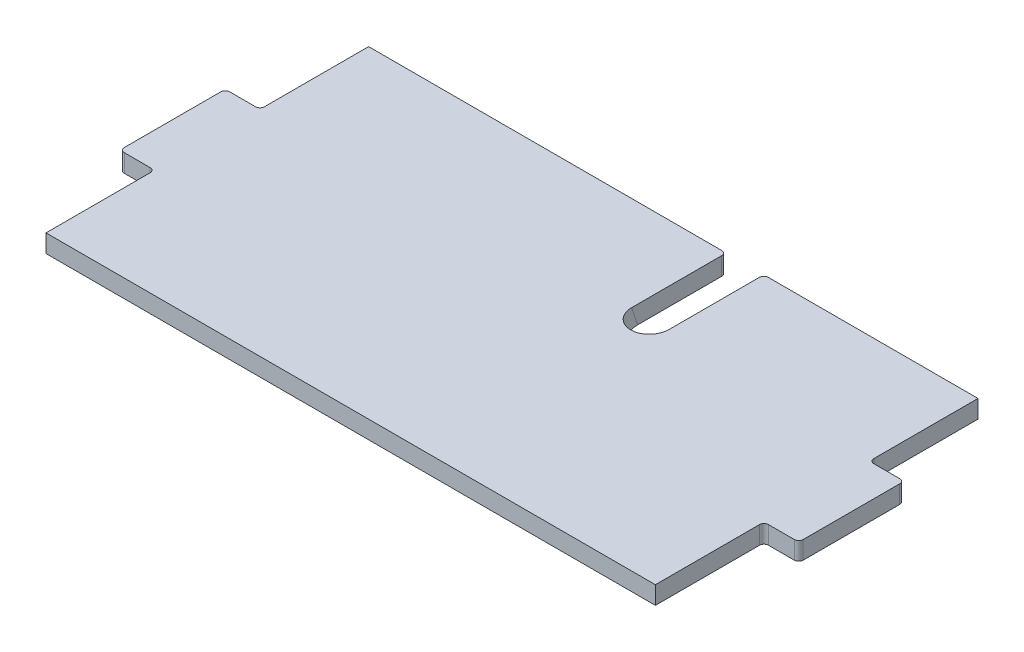
ISO-10303-21;
HEADER;
FILE_DESCRIPTION(('STEP AP214'),'2;1');
FILE_NAME('part.step','',(''),(''),'','','');
FILE_SCHEMA(('AUTOMOTIVE_DESIGN { 1 0 10303 214 1 1 1 1 }'));
ENDSEC;
DATA;
#1=APPLICATION_CONTEXT('core data for automotive mechanical design processes');
#2=APPLICATION_PROTOCOL_DEFINITION('international standard','automotive_design',2000,#1);
#3=PRODUCT_CONTEXT('',#1,'mechanical');
#4=PRODUCT('Part','Part','',(#3));
#5=PRODUCT_RELATED_PRODUCT_CATEGORY('part','',(#4));
#6=PRODUCT_DEFINITION_FORMATION('','',#4);
#7=PRODUCT_DEFINITION_CONTEXT('part definition',#1,'design');
#8=PRODUCT_DEFINITION('design','',#6,#7);
#9=PRODUCT_DEFINITION_SHAPE('','',#8);
#10=(LENGTH_UNIT() NAMED_UNIT(*) SI_UNIT(.MILLI.,.METRE.));
#11=(NAMED_UNIT(*) PLANE_ANGLE_UNIT() SI_UNIT($,.RADIAN.));
#12=(NAMED_UNIT(*) SI_UNIT($,.STERADIAN.) SOLID_ANGLE_UNIT());
#13=UNCERTAINTY_MEASURE_WITH_UNIT(LENGTH_MEASURE(1.E-05),#10,'distance_accuracy_value','');
#14=(GEOMETRIC_REPRESENTATION_CONTEXT(3) GLOBAL_UNCERTAINTY_ASSIGNED_CONTEXT((#13)) GLOBAL_UNIT_ASSIGNED_CONTEXT((#10,
#11,#12)) REPRESENTATION_CONTEXT('',''));
#15=CARTESIAN_POINT('',(0.,0.,0.));
#16=DIRECTION('',(0.,0.,1.));
#17=DIRECTION('',(1.,0.,0.));
#18=AXIS2_PLACEMENT_3D('',#15,#16,#17);
#19=CARTESIAN_POINT('',(-215.9,6.35,-88.9));
#20=DIRECTION('',(0.,0.,1.));
#21=DIRECTION('',(1.,0.,0.));
#22=AXIS2_PLACEMENT_3D('',#19,#20,#21);
#23=PLANE('',#22);
#24=DIRECTION('',(-1.,0.,0.));
#25=VECTOR('',#24,1.);
#26=CARTESIAN_POINT('',(-215.9,6.35,-88.9));
#27=LINE('',#26,#25);
#28=CARTESIAN_POINT('',(34.2899999999983,6.35,-88.9));
#29=VERTEX_POINT('',#28);
#30=CARTESIAN_POINT('',(-215.9,6.35,-88.9));
#31=VERTEX_POINT('',#30);
#32=EDGE_CURVE('E261',#29,#31,#27,.T.);
#33=ORIENTED_EDGE('',*,*,#32,.F.);
#34=DIRECTION('',(0.,1.,0.));
#35=VECTOR('',#34,1.);
#36=CARTESIAN_POINT('',(34.2899999999983,6.35,-88.9));
#37=LINE('',#36,#35);
#38=CARTESIAN_POINT('',(34.2899999999983,-6.35,-88.9));
#39=VERTEX_POINT('',#38);
#40=EDGE_CURVE('E226',#29,#39,#37,.F.);
#41=ORIENTED_EDGE('',*,*,#40,.T.);
#42=DIRECTION('',(-1.,0.,0.));
#43=VECTOR('',#42,1.);
#44=CARTESIAN_POINT('',(-215.9,-6.35,-88.9));
#45=LINE('',#44,#43);
#46=CARTESIAN_POINT('',(-215.9,-6.35,-88.9));
#47=VERTEX_POINT('',#46);
#48=EDGE_CURVE('E220',#39,#47,#45,.T.);
#49=ORIENTED_EDGE('',*,*,#48,.T.);
#50=DIRECTION('',(0.,-1.,0.));
#51=VECTOR('',#50,1.);
#52=CARTESIAN_POINT('',(-215.9,6.35,-88.9));
#53=LINE('',#52,#51);
#54=EDGE_CURVE('E223',#31,#47,#53,.T.);
#55=ORIENTED_EDGE('',*,*,#54,.F.);
#56=EDGE_LOOP('',(#33,#41,#49,#55));
#57=FACE_BOUND('',#56,.T.);
#58=ADVANCED_FACE('F44',(#57),#23,.F.);
#59=CARTESIAN_POINT('',(-215.9,6.35,-88.9));
#60=DIRECTION('',(1.,0.,0.));
#61=DIRECTION('',(0.,0.,-1.));
#62=AXIS2_PLACEMENT_3D('',#59,#60,#61);
#63=PLANE('',#62);
#64=DIRECTION('',(0.,0.,1.));
#65=VECTOR('',#64,1.);
#66=CARTESIAN_POINT('',(-215.9,-6.35,-88.9));
#67=LINE('',#66,#65);
#68=CARTESIAN_POINT('',(-215.9,-6.35,-15.113));
#69=VERTEX_POINT('',#68);
#70=EDGE_CURVE('E237',#47,#69,#67,.T.);
#71=ORIENTED_EDGE('',*,*,#70,.T.);
#72=DIRECTION('',(0.,-1.,0.));
#73=VECTOR('',#72,1.);
#74=CARTESIAN_POINT('',(-215.9,6.35,-15.113));
#75=LINE('',#74,#73);
#76=CARTESIAN_POINT('',(-215.9,6.35,-15.113));
#77=VERTEX_POINT('',#76);
#78=EDGE_CURVE('E439',#69,#77,#75,.F.);
#79=ORIENTED_EDGE('',*,*,#78,.T.);
#80=DIRECTION('',(0.,0.,1.));
#81=VECTOR('',#80,1.);
#82=CARTESIAN_POINT('',(-215.9,6.35,-88.9));
#83=LINE('',#82,#81);
#84=EDGE_CURVE('E240',#31,#77,#83,.T.);
#85=ORIENTED_EDGE('',*,*,#84,.F.);
#86=ORIENTED_EDGE('',*,*,#54,.T.);
#87=EDGE_LOOP('',(#71,#79,#85,#86));
#88=FACE_BOUND('',#87,.T.);
#89=ADVANCED_FACE('F236',(#88),#63,.F.);
#90=CARTESIAN_POINT('',(-241.3,6.35,-11.938));
#91=DIRECTION('',(0.,0.,1.));
#92=DIRECTION('',(1.,0.,0.));
#93=AXIS2_PLACEMENT_3D('',#90,#91,#92);
#94=PLANE('',#93);
#95=DIRECTION('',(-1.,0.,0.));
#96=VECTOR('',#95,1.);
#97=CARTESIAN_POINT('',(-241.3,-6.35,-11.938));
#98=LINE('',#97,#96);
#99=CARTESIAN_POINT('',(-219.075,-6.35,-11.938));
#100=VERTEX_POINT('',#99);
#101=CARTESIAN_POINT('',(-237.363,-6.35,-11.938));
#102=VERTEX_POINT('',#101);
#103=EDGE_CURVE('E242',#100,#102,#98,.T.);
#104=ORIENTED_EDGE('',*,*,#103,.T.);
#105=DIRECTION('',(0.,-1.,0.));
#106=VECTOR('',#105,1.);
#107=CARTESIAN_POINT('',(-237.363,6.35,-11.938));
#108=LINE('',#107,#106);
#109=CARTESIAN_POINT('',(-237.363,6.35,-11.938));
#110=VERTEX_POINT('',#109);
#111=EDGE_CURVE('E436',#102,#110,#108,.F.);
#112=ORIENTED_EDGE('',*,*,#111,.T.);
#113=DIRECTION('',(-1.,0.,0.));
#114=VECTOR('',#113,1.);
#115=CARTESIAN_POINT('',(-241.3,6.35,-11.938));
#116=LINE('',#115,#114);
#117=CARTESIAN_POINT('',(-219.075,6.35,-11.938));
#118=VERTEX_POINT('',#117);
#119=EDGE_CURVE('E280',#118,#110,#116,.T.);
#120=ORIENTED_EDGE('',*,*,#119,.F.);
#121=DIRECTION('',(0.,-1.,0.));
#122=VECTOR('',#121,1.);
#123=CARTESIAN_POINT('',(-219.075,-6.35,-11.938));
#124=LINE('',#123,#122);
#125=EDGE_CURVE('E432',#118,#100,#124,.T.);
#126=ORIENTED_EDGE('',*,*,#125,.T.);
#127=EDGE_LOOP('',(#104,#112,#120,#126));
#128=FACE_BOUND('',#127,.T.);
#129=ADVANCED_FACE('F576',(#128),#94,.F.);
#130=CARTESIAN_POINT('',(-240.538,6.35,-12.7));
#131=DIRECTION('',(1.,0.,0.));
#132=DIRECTION('',(0.,0.,-1.));
#133=AXIS2_PLACEMENT_3D('',#130,#131,#132);
#134=PLANE('',#133);
#135=DIRECTION('',(0.,0.,1.));
#136=VECTOR('',#135,1.);
#137=CARTESIAN_POINT('',(-240.538,-6.35,-12.7));
#138=LINE('',#137,#136);
#139=CARTESIAN_POINT('',(-240.538,-6.35,-8.76299999999999));
#140=VERTEX_POINT('',#139);
#141=CARTESIAN_POINT('',(-240.538,-6.35,59.563));
#142=VERTEX_POINT('',#141);
#143=EDGE_CURVE('E309',#140,#142,#138,.T.);
#144=ORIENTED_EDGE('',*,*,#143,.T.);
#145=DIRECTION('',(0.,-1.,0.));
#146=VECTOR('',#145,1.);
#147=CARTESIAN_POINT('',(-240.538,6.35,59.563));
#148=LINE('',#147,#146);
#149=CARTESIAN_POINT('',(-240.538,6.35,59.563));
#150=VERTEX_POINT('',#149);
#151=EDGE_CURVE('E429',#142,#150,#148,.F.);
#152=ORIENTED_EDGE('',*,*,#151,.T.);
#153=DIRECTION('',(0.,0.,1.));
#154=VECTOR('',#153,1.);
#155=CARTESIAN_POINT('',(-240.538,6.35,-12.7));
#156=LINE('',#155,#154);
#157=CARTESIAN_POINT('',(-240.538,6.35,-8.76299999999999));
#158=VERTEX_POINT('',#157);
#159=EDGE_CURVE('E319',#158,#150,#156,.T.);
#160=ORIENTED_EDGE('',*,*,#159,.F.);
#161=DIRECTION('',(0.,-1.,0.));
#162=VECTOR('',#161,1.);
#163=CARTESIAN_POINT('',(-240.538,6.35,-8.76299999999999));
#164=LINE('',#163,#162);
#165=EDGE_CURVE('E425',#158,#140,#164,.T.);
#166=ORIENTED_EDGE('',*,*,#165,.T.);
#167=EDGE_LOOP('',(#144,#152,#160,#166));
#168=FACE_BOUND('',#167,.T.);
#169=ADVANCED_FACE('F600',(#168),#134,.F.);
#170=CARTESIAN_POINT('',(-215.9,6.35,62.738));
#171=DIRECTION('',(0.,0.,-1.));
#172=DIRECTION('',(-1.,0.,0.));
#173=AXIS2_PLACEMENT_3D('',#170,#171,#172);
#174=PLANE('',#173);
#175=DIRECTION('',(1.,0.,0.));
#176=VECTOR('',#175,1.);
#177=CARTESIAN_POINT('',(-215.9,-6.35,62.738));
#178=LINE('',#177,#176);
#179=CARTESIAN_POINT('',(-237.363,-6.35,62.738));
#180=VERTEX_POINT('',#179);
#181=CARTESIAN_POINT('',(-219.075,-6.35,62.738));
#182=VERTEX_POINT('',#181);
#183=EDGE_CURVE('E305',#180,#182,#178,.T.);
#184=ORIENTED_EDGE('',*,*,#183,.T.);
#185=DIRECTION('',(0.,-1.,0.));
#186=VECTOR('',#185,1.);
#187=CARTESIAN_POINT('',(-219.075,6.35,62.738));
#188=LINE('',#187,#186);
#189=CARTESIAN_POINT('',(-219.075,6.35,62.738));
#190=VERTEX_POINT('',#189);
#191=EDGE_CURVE('E422',#182,#190,#188,.F.);
#192=ORIENTED_EDGE('',*,*,#191,.T.);
#193=DIRECTION('',(1.,0.,0.));
#194=VECTOR('',#193,1.);
#195=CARTESIAN_POINT('',(-215.9,6.35,62.738));
#196=LINE('',#195,#194);
#197=CARTESIAN_POINT('',(-237.363,6.35,62.738));
#198=VERTEX_POINT('',#197);
#199=EDGE_CURVE('E277',#198,#190,#196,.T.);
#200=ORIENTED_EDGE('',*,*,#199,.F.);
#201=DIRECTION('',(0.,-1.,0.));
#202=VECTOR('',#201,1.);
#203=CARTESIAN_POINT('',(-237.363,6.35,62.738));
#204=LINE('',#203,#202);
#205=EDGE_CURVE('E418',#198,#180,#204,.T.);
#206=ORIENTED_EDGE('',*,*,#205,.T.);
#207=EDGE_LOOP('',(#184,#192,#200,#206));
#208=FACE_BOUND('',#207,.T.);
#209=ADVANCED_FACE('F596',(#208),#174,.F.);
#210=CARTESIAN_POINT('',(-215.9,6.35,63.5));
#211=DIRECTION('',(1.,0.,0.));
#212=DIRECTION('',(0.,0.,-1.));
#213=AXIS2_PLACEMENT_3D('',#210,#211,#212);
#214=PLANE('',#213);
#215=DIRECTION('',(0.,0.,1.));
#216=VECTOR('',#215,1.);
#217=CARTESIAN_POINT('',(-215.9,6.35,63.5));
#218=LINE('',#217,#216);
#219=CARTESIAN_POINT('',(-215.9,6.35,65.913));
#220=VERTEX_POINT('',#219);
#221=CARTESIAN_POINT('',(-215.9,6.35,139.7));
#222=VERTEX_POINT('',#221);
#223=EDGE_CURVE('E274',#220,#222,#218,.T.);
#224=ORIENTED_EDGE('',*,*,#223,.F.);
#225=DIRECTION('',(0.,-1.,0.));
#226=VECTOR('',#225,1.);
#227=CARTESIAN_POINT('',(-215.9,-6.35,65.913));
#228=LINE('',#227,#226);
#229=CARTESIAN_POINT('',(-215.9,-6.35,65.913));
#230=VERTEX_POINT('',#229);
#231=EDGE_CURVE('E414',#220,#230,#228,.T.);
#232=ORIENTED_EDGE('',*,*,#231,.T.);
#233=DIRECTION('',(0.,0.,1.));
#234=VECTOR('',#233,1.);
#235=CARTESIAN_POINT('',(-215.9,-6.35,63.5));
#236=LINE('',#235,#234);
#237=CARTESIAN_POINT('',(-215.9,-6.35,139.7));
#238=VERTEX_POINT('',#237);
#239=EDGE_CURVE('E255',#230,#238,#236,.T.);
#240=ORIENTED_EDGE('',*,*,#239,.T.);
#241=DIRECTION('',(0.,-1.,0.));
#242=VECTOR('',#241,1.);
#243=CARTESIAN_POINT('',(-215.9,6.35,139.7));
#244=LINE('',#243,#242);
#245=EDGE_CURVE('E486',#222,#238,#244,.T.);
#246=ORIENTED_EDGE('',*,*,#245,.F.);
#247=EDGE_LOOP('',(#224,#232,#240,#246));
#248=FACE_BOUND('',#247,.T.);
#249=ADVANCED_FACE('F497',(#248),#214,.F.);
#250=CARTESIAN_POINT('',(-215.9,6.35,139.7));
#251=DIRECTION('',(0.,0.,-1.));
#252=DIRECTION('',(-1.,0.,0.));
#253=AXIS2_PLACEMENT_3D('',#250,#251,#252);
#254=PLANE('',#253);
#255=DIRECTION('',(1.,0.,0.));
#256=VECTOR('',#255,1.);
#257=CARTESIAN_POINT('',(-215.9,-6.35,139.7));
#258=LINE('',#257,#256);
#259=CARTESIAN_POINT('',(215.9,-6.35,139.7));
#260=VERTEX_POINT('',#259);
#261=EDGE_CURVE('E490',#238,#260,#258,.T.);
#262=ORIENTED_EDGE('',*,*,#261,.T.);
#263=DIRECTION('',(0.,-1.,0.));
#264=VECTOR('',#263,1.);
#265=CARTESIAN_POINT('',(215.9,6.35,139.7));
#266=LINE('',#265,#264);
#267=CARTESIAN_POINT('',(215.9,6.35,139.7));
#268=VERTEX_POINT('',#267);
#269=EDGE_CURVE('E287',#268,#260,#266,.T.);
#270=ORIENTED_EDGE('',*,*,#269,.F.);
#271=DIRECTION('',(1.,0.,0.));
#272=VECTOR('',#271,1.);
#273=CARTESIAN_POINT('',(-215.9,6.35,139.7));
#274=LINE('',#273,#272);
#275=EDGE_CURVE('E271',#222,#268,#274,.T.);
#276=ORIENTED_EDGE('',*,*,#275,.F.);
#277=ORIENTED_EDGE('',*,*,#245,.T.);
#278=EDGE_LOOP('',(#262,#270,#276,#277));
#279=FACE_BOUND('',#278,.T.);
#280=ADVANCED_FACE('F502',(#279),#254,.F.);
#281=CARTESIAN_POINT('',(215.9,6.35,63.5));
#282=DIRECTION('',(-1.,0.,0.));
#283=DIRECTION('',(0.,0.,1.));
#284=AXIS2_PLACEMENT_3D('',#281,#282,#283);
#285=PLANE('',#284);
#286=DIRECTION('',(0.,0.,-1.));
#287=VECTOR('',#286,1.);
#288=CARTESIAN_POINT('',(215.9,-6.35,63.5));
#289=LINE('',#288,#287);
#290=CARTESIAN_POINT('',(215.9,-6.35,65.913));
#291=VERTEX_POINT('',#290);
#292=EDGE_CURVE('E482',#260,#291,#289,.T.);
#293=ORIENTED_EDGE('',*,*,#292,.T.);
#294=DIRECTION('',(0.,-1.,0.));
#295=VECTOR('',#294,1.);
#296=CARTESIAN_POINT('',(215.9,6.35,65.913));
#297=LINE('',#296,#295);
#298=CARTESIAN_POINT('',(215.9,6.35,65.913));
#299=VERTEX_POINT('',#298);
#300=EDGE_CURVE('E411',#291,#299,#297,.F.);
#301=ORIENTED_EDGE('',*,*,#300,.T.);
#302=DIRECTION('',(0.,0.,-1.));
#303=VECTOR('',#302,1.);
#304=CARTESIAN_POINT('',(215.9,6.35,63.5));
#305=LINE('',#304,#303);
#306=EDGE_CURVE('E266',#268,#299,#305,.T.);
#307=ORIENTED_EDGE('',*,*,#306,.F.);
#308=ORIENTED_EDGE('',*,*,#269,.T.);
#309=EDGE_LOOP('',(#293,#301,#307,#308));
#310=FACE_BOUND('',#309,.T.);
#311=ADVANCED_FACE('F508',(#310),#285,.F.);
#312=CARTESIAN_POINT('',(215.9,6.35,62.738));
#313=DIRECTION('',(0.,0.,-1.));
#314=DIRECTION('',(-1.,0.,0.));
#315=AXIS2_PLACEMENT_3D('',#312,#313,#314);
#316=PLANE('',#315);
#317=DIRECTION('',(1.,0.,0.));
#318=VECTOR('',#317,1.);
#319=CARTESIAN_POINT('',(215.9,-6.35,62.738));
#320=LINE('',#319,#318);
#321=CARTESIAN_POINT('',(219.075,-6.35,62.738));
#322=VERTEX_POINT('',#321);
#323=CARTESIAN_POINT('',(237.363,-6.35,62.738));
#324=VERTEX_POINT('',#323);
#325=EDGE_CURVE('E282',#322,#324,#320,.T.);
#326=ORIENTED_EDGE('',*,*,#325,.T.);
#327=DIRECTION('',(0.,-1.,0.));
#328=VECTOR('',#327,1.);
#329=CARTESIAN_POINT('',(237.363,6.35,62.738));
#330=LINE('',#329,#328);
#331=CARTESIAN_POINT('',(237.363,6.35,62.738));
#332=VERTEX_POINT('',#331);
#333=EDGE_CURVE('E408',#324,#332,#330,.F.);
#334=ORIENTED_EDGE('',*,*,#333,.T.);
#335=DIRECTION('',(1.,0.,0.));
#336=VECTOR('',#335,1.);
#337=CARTESIAN_POINT('',(215.9,6.35,62.738));
#338=LINE('',#337,#336);
#339=CARTESIAN_POINT('',(219.075,6.35,62.738));
#340=VERTEX_POINT('',#339);
#341=EDGE_CURVE('E270',#340,#332,#338,.T.);
#342=ORIENTED_EDGE('',*,*,#341,.F.);
#343=DIRECTION('',(0.,-1.,0.));
#344=VECTOR('',#343,1.);
#345=CARTESIAN_POINT('',(219.075,-6.35,62.738));
#346=LINE('',#345,#344);
#347=EDGE_CURVE('E404',#340,#322,#346,.T.);
#348=ORIENTED_EDGE('',*,*,#347,.T.);
#349=EDGE_LOOP('',(#326,#334,#342,#348));
#350=FACE_BOUND('',#349,.T.);
#351=ADVANCED_FACE('F518',(#350),#316,.F.);
#352=CARTESIAN_POINT('',(240.538,6.35,-12.7));
#353=DIRECTION('',(-1.,0.,0.));
#354=DIRECTION('',(0.,0.,1.));
#355=AXIS2_PLACEMENT_3D('',#352,#353,#354);
#356=PLANE('',#355);
#357=DIRECTION('',(0.,0.,-1.));
#358=VECTOR('',#357,1.);
#359=CARTESIAN_POINT('',(240.538,-6.35,-12.7));
#360=LINE('',#359,#358);
#361=CARTESIAN_POINT('',(240.538,-6.35,59.563));
#362=VERTEX_POINT('',#361);
#363=CARTESIAN_POINT('',(240.538,-6.35,-8.76299999999999));
#364=VERTEX_POINT('',#363);
#365=EDGE_CURVE('E286',#362,#364,#360,.T.);
#366=ORIENTED_EDGE('',*,*,#365,.T.);
#367=DIRECTION('',(0.,-1.,0.));
#368=VECTOR('',#367,1.);
#369=CARTESIAN_POINT('',(240.538,6.35,-8.76299999999999));
#370=LINE('',#369,#368);
#371=CARTESIAN_POINT('',(240.538,6.35,-8.76299999999999));
#372=VERTEX_POINT('',#371);
#373=EDGE_CURVE('E384',#364,#372,#370,.F.);
#374=ORIENTED_EDGE('',*,*,#373,.T.);
#375=DIRECTION('',(0.,0.,-1.));
#376=VECTOR('',#375,1.);
#377=CARTESIAN_POINT('',(240.538,6.35,-12.7));
#378=LINE('',#377,#376);
#379=CARTESIAN_POINT('',(240.538,6.35,59.563));
#380=VERTEX_POINT('',#379);
#381=EDGE_CURVE('E291',#380,#372,#378,.T.);
#382=ORIENTED_EDGE('',*,*,#381,.F.);
#383=DIRECTION('',(0.,-1.,0.));
#384=VECTOR('',#383,1.);
#385=CARTESIAN_POINT('',(240.538,6.35,59.563));
#386=LINE('',#385,#384);
#387=EDGE_CURVE('E380',#380,#362,#386,.T.);
#388=ORIENTED_EDGE('',*,*,#387,.T.);
#389=EDGE_LOOP('',(#366,#374,#382,#388));
#390=FACE_BOUND('',#389,.T.);
#391=ADVANCED_FACE('F526',(#390),#356,.F.);
#392=CARTESIAN_POINT('',(241.3,6.35,-11.938));
#393=DIRECTION('',(0.,0.,1.));
#394=DIRECTION('',(1.,0.,0.));
#395=AXIS2_PLACEMENT_3D('',#392,#393,#394);
#396=PLANE('',#395);
#397=DIRECTION('',(-1.,0.,0.));
#398=VECTOR('',#397,1.);
#399=CARTESIAN_POINT('',(241.3,-6.35,-11.938));
#400=LINE('',#399,#398);
#401=CARTESIAN_POINT('',(237.363,-6.35,-11.938));
#402=VERTEX_POINT('',#401);
#403=CARTESIAN_POINT('',(219.075,-6.35,-11.938));
#404=VERTEX_POINT('',#403);
#405=EDGE_CURVE('E298',#402,#404,#400,.T.);
#406=ORIENTED_EDGE('',*,*,#405,.T.);
#407=DIRECTION('',(0.,-1.,0.));
#408=VECTOR('',#407,1.);
#409=CARTESIAN_POINT('',(219.075,6.35,-11.938));
#410=LINE('',#409,#408);
#411=CARTESIAN_POINT('',(219.075,6.35,-11.938));
#412=VERTEX_POINT('',#411);
#413=EDGE_CURVE('E359',#404,#412,#410,.F.);
#414=ORIENTED_EDGE('',*,*,#413,.T.);
#415=DIRECTION('',(-1.,0.,0.));
#416=VECTOR('',#415,1.);
#417=CARTESIAN_POINT('',(241.3,6.35,-11.938));
#418=LINE('',#417,#416);
#419=CARTESIAN_POINT('',(237.363,6.35,-11.938));
#420=VERTEX_POINT('',#419);
#421=EDGE_CURVE('E265',#420,#412,#418,.T.);
#422=ORIENTED_EDGE('',*,*,#421,.F.);
#423=DIRECTION('',(0.,-1.,0.));
#424=VECTOR('',#423,1.);
#425=CARTESIAN_POINT('',(237.363,6.35,-11.938));
#426=LINE('',#425,#424);
#427=EDGE_CURVE('E355',#420,#402,#426,.T.);
#428=ORIENTED_EDGE('',*,*,#427,.T.);
#429=EDGE_LOOP('',(#406,#414,#422,#428));
#430=FACE_BOUND('',#429,.T.);
#431=ADVANCED_FACE('F535',(#430),#396,.F.);
#432=CARTESIAN_POINT('',(215.9,6.35,-88.9));
#433=DIRECTION('',(-1.,0.,0.));
#434=DIRECTION('',(0.,0.,1.));
#435=AXIS2_PLACEMENT_3D('',#432,#433,#434);
#436=PLANE('',#435);
#437=DIRECTION('',(0.,0.,-1.));
#438=VECTOR('',#437,1.);
#439=CARTESIAN_POINT('',(215.9,6.35,-88.9));
#440=LINE('',#439,#438);
#441=CARTESIAN_POINT('',(215.9,6.35,-15.113));
#442=VERTEX_POINT('',#441);
#443=CARTESIAN_POINT('',(215.9,6.35,-88.9));
#444=VERTEX_POINT('',#443);
#445=EDGE_CURVE('E262',#442,#444,#440,.T.);
#446=ORIENTED_EDGE('',*,*,#445,.F.);
#447=DIRECTION('',(0.,-1.,0.));
#448=VECTOR('',#447,1.);
#449=CARTESIAN_POINT('',(215.9,-6.35,-15.113));
#450=LINE('',#449,#448);
#451=CARTESIAN_POINT('',(215.9,-6.35,-15.113));
#452=VERTEX_POINT('',#451);
#453=EDGE_CURVE('E348',#442,#452,#450,.T.);
#454=ORIENTED_EDGE('',*,*,#453,.T.);
#455=DIRECTION('',(0.,0.,-1.));
#456=VECTOR('',#455,1.);
#457=CARTESIAN_POINT('',(215.9,-6.35,-88.9));
#458=LINE('',#457,#456);
#459=CARTESIAN_POINT('',(215.9,-6.35,-88.9));
#460=VERTEX_POINT('',#459);
#461=EDGE_CURVE('E232',#452,#460,#458,.T.);
#462=ORIENTED_EDGE('',*,*,#461,.T.);
#463=DIRECTION('',(0.,-1.,0.));
#464=VECTOR('',#463,1.);
#465=CARTESIAN_POINT('',(215.9,6.35,-88.9));
#466=LINE('',#465,#464);
#467=EDGE_CURVE('E336',#444,#460,#466,.T.);
#468=ORIENTED_EDGE('',*,*,#467,.F.);
#469=EDGE_LOOP('',(#446,#454,#462,#468));
#470=FACE_BOUND('',#469,.T.);
#471=ADVANCED_FACE('F543',(#470),#436,.F.);
#472=CARTESIAN_POINT('',(67.3099999999985,-6.35,-88.9));
#473=VERTEX_POINT('',#472);
#474=EDGE_CURVE('E231',#460,#473,#45,.T.);
#475=ORIENTED_EDGE('',*,*,#474,.T.);
#476=DIRECTION('',(0.,-1.,0.));
#477=VECTOR('',#476,1.);
#478=CARTESIAN_POINT('',(67.3099999999985,6.35,-88.9));
#479=LINE('',#478,#477);
#480=CARTESIAN_POINT('',(67.3099999999985,6.35,-88.9));
#481=VERTEX_POINT('',#480);
#482=EDGE_CURVE('E68',#473,#481,#479,.F.);
#483=ORIENTED_EDGE('',*,*,#482,.T.);
#484=EDGE_CURVE('E257',#444,#481,#27,.T.);
#485=ORIENTED_EDGE('',*,*,#484,.F.);
#486=ORIENTED_EDGE('',*,*,#467,.T.);
#487=EDGE_LOOP('',(#475,#483,#485,#486));
#488=FACE_BOUND('',#487,.T.);
#489=ADVANCED_FACE('F546',(#488),#23,.F.);
#490=CARTESIAN_POINT('',(0.,6.35,0.));
#491=DIRECTION('',(0.,1.,0.));
#492=DIRECTION('',(0.,0.,1.));
#493=AXIS2_PLACEMENT_3D('',#490,#491,#492);
#494=PLANE('',#493);
#495=ORIENTED_EDGE('',*,*,#381,.T.);
#496=CARTESIAN_POINT('',(237.363,6.35,-8.76299999999999));
#497=DIRECTION('',(0.,1.,0.));
#498=DIRECTION('',(0.,0.,1.));
#499=AXIS2_PLACEMENT_3D('',#496,#497,#498);
#500=CIRCLE('',#499,3.175);
#501=EDGE_CURVE('E401',#372,#420,#500,.T.);
#502=ORIENTED_EDGE('',*,*,#501,.T.);
#503=ORIENTED_EDGE('',*,*,#421,.T.);
#504=CARTESIAN_POINT('',(219.075,6.35,-15.113));
#505=DIRECTION('',(0.,1.,0.));
#506=DIRECTION('',(0.,0.,1.));
#507=AXIS2_PLACEMENT_3D('',#504,#505,#506);
#508=CIRCLE('',#507,3.175);
#509=EDGE_CURVE('E457',#412,#442,#508,.F.);
#510=ORIENTED_EDGE('',*,*,#509,.T.);
#511=ORIENTED_EDGE('',*,*,#445,.T.);
#512=ORIENTED_EDGE('',*,*,#484,.T.);
#513=CARTESIAN_POINT('',(67.3099999999985,6.35,-85.725));
#514=DIRECTION('',(0.,1.,0.));
#515=DIRECTION('',(0.,0.,1.));
#516=AXIS2_PLACEMENT_3D('',#513,#514,#515);
#517=CIRCLE('',#516,3.175);
#518=CARTESIAN_POINT('',(64.1349999999985,6.35,-85.725));
#519=VERTEX_POINT('',#518);
#520=EDGE_CURVE('E60',#481,#519,#517,.T.);
#521=ORIENTED_EDGE('',*,*,#520,.T.);
#522=DIRECTION('',(0.,0.,-1.));
#523=VECTOR('',#522,1.);
#524=CARTESIAN_POINT('',(64.1349999999985,6.35,0.));
#525=LINE('',#524,#523);
#526=CARTESIAN_POINT('',(64.1349999999985,6.34999999999997,-21.9362936905283));
#527=VERTEX_POINT('',#526);
#528=EDGE_CURVE('E329',#527,#519,#525,.T.);
#529=ORIENTED_EDGE('',*,*,#528,.F.);
#530=CARTESIAN_POINT('',(50.7999999999984,6.34999999999997,-21.9362936905283));
#531=DIRECTION('',(0.,1.,0.));
#532=DIRECTION('',(0.,0.,-1.));
#533=AXIS2_PLACEMENT_3D('',#530,#531,#532);
#534=ELLIPSE('',#533,14.0350269898215,13.3350000000001);
#535=CARTESIAN_POINT('',(37.4649999999983,6.34999999999997,-21.9362936905283));
#536=VERTEX_POINT('',#535);
#537=EDGE_CURVE('E281',#527,#536,#534,.F.);
#538=ORIENTED_EDGE('',*,*,#537,.T.);
#539=DIRECTION('',(0.,0.,-1.));
#540=VECTOR('',#539,1.);
#541=CARTESIAN_POINT('',(37.4649999999983,6.35,139.701));
#542=LINE('',#541,#540);
#543=CARTESIAN_POINT('',(37.4649999999983,6.35,-85.725));
#544=VERTEX_POINT('',#543);
#545=EDGE_CURVE('E332',#536,#544,#542,.T.);
#546=ORIENTED_EDGE('',*,*,#545,.T.);
#547=CARTESIAN_POINT('',(34.2899999999983,6.35,-85.725));
#548=DIRECTION('',(0.,1.,0.));
#549=DIRECTION('',(0.,0.,1.));
#550=AXIS2_PLACEMENT_3D('',#547,#548,#549);
#551=CIRCLE('',#550,3.175);
#552=EDGE_CURVE('E389',#544,#29,#551,.T.);
#553=ORIENTED_EDGE('',*,*,#552,.T.);
#554=ORIENTED_EDGE('',*,*,#32,.T.);
#555=ORIENTED_EDGE('',*,*,#84,.T.);
#556=CARTESIAN_POINT('',(-219.075,6.35,-15.113));
#557=DIRECTION('',(0.,1.,0.));
#558=DIRECTION('',(0.,0.,1.));
#559=AXIS2_PLACEMENT_3D('',#556,#557,#558);
#560=CIRCLE('',#559,3.175);
#561=EDGE_CURVE('E12',#77,#118,#560,.F.);
#562=ORIENTED_EDGE('',*,*,#561,.T.);
#563=ORIENTED_EDGE('',*,*,#119,.T.);
#564=CARTESIAN_POINT('',(-237.363,6.35,-8.76299999999999));
#565=DIRECTION('',(0.,1.,0.));
#566=DIRECTION('',(0.,0.,1.));
#567=AXIS2_PLACEMENT_3D('',#564,#565,#566);
#568=CIRCLE('',#567,3.175);
#569=EDGE_CURVE('E392',#110,#158,#568,.T.);
#570=ORIENTED_EDGE('',*,*,#569,.T.);
#571=ORIENTED_EDGE('',*,*,#159,.T.);
#572=CARTESIAN_POINT('',(-237.363,6.35,59.563));
#573=DIRECTION('',(0.,1.,0.));
#574=DIRECTION('',(0.,0.,1.));
#575=AXIS2_PLACEMENT_3D('',#572,#573,#574);
#576=CIRCLE('',#575,3.175);
#577=EDGE_CURVE('E395',#150,#198,#576,.T.);
#578=ORIENTED_EDGE('',*,*,#577,.T.);
#579=ORIENTED_EDGE('',*,*,#199,.T.);
#580=CARTESIAN_POINT('',(-219.075,6.35,65.913));
#581=DIRECTION('',(0.,1.,0.));
#582=DIRECTION('',(0.,0.,1.));
#583=AXIS2_PLACEMENT_3D('',#580,#581,#582);
#584=CIRCLE('',#583,3.175);
#585=EDGE_CURVE('E469',#190,#220,#584,.F.);
#586=ORIENTED_EDGE('',*,*,#585,.T.);
#587=ORIENTED_EDGE('',*,*,#223,.T.);
#588=ORIENTED_EDGE('',*,*,#275,.T.);
#589=ORIENTED_EDGE('',*,*,#306,.T.);
#590=CARTESIAN_POINT('',(219.075,6.35,65.913));
#591=DIRECTION('',(0.,1.,0.));
#592=DIRECTION('',(0.,0.,1.));
#593=AXIS2_PLACEMENT_3D('',#590,#591,#592);
#594=CIRCLE('',#593,3.175);
#595=EDGE_CURVE('E463',#299,#340,#594,.F.);
#596=ORIENTED_EDGE('',*,*,#595,.T.);
#597=ORIENTED_EDGE('',*,*,#341,.T.);
#598=CARTESIAN_POINT('',(237.363,6.35,59.563));
#599=DIRECTION('',(0.,1.,0.));
#600=DIRECTION('',(0.,0.,1.));
#601=AXIS2_PLACEMENT_3D('',#598,#599,#600);
#602=CIRCLE('',#601,3.175);
#603=EDGE_CURVE('E398',#332,#380,#602,.T.);
#604=ORIENTED_EDGE('',*,*,#603,.T.);
#605=EDGE_LOOP('',(#495,#502,#503,#510,#511,#512,#521,#529,#538,#546,#553,#554,#555,#562,#563,
#570,#571,#578,#579,#586,#587,#588,#589,#596,#597,#604));
#606=FACE_BOUND('',#605,.T.);
#607=ADVANCED_FACE('F515',(#606),#494,.T.);
#608=CARTESIAN_POINT('',(0.,-6.35,0.));
#609=DIRECTION('',(0.,1.,0.));
#610=DIRECTION('',(0.,0.,1.));
#611=AXIS2_PLACEMENT_3D('',#608,#609,#610);
#612=PLANE('',#611);
#613=ORIENTED_EDGE('',*,*,#405,.F.);
#614=CARTESIAN_POINT('',(237.363,-6.35,-8.76299999999999));
#615=DIRECTION('',(0.,1.,0.));
#616=DIRECTION('',(0.,0.,1.));
#617=AXIS2_PLACEMENT_3D('',#614,#615,#616);
#618=CIRCLE('',#617,3.175);
#619=EDGE_CURVE('E377',#402,#364,#618,.F.);
#620=ORIENTED_EDGE('',*,*,#619,.T.);
#621=ORIENTED_EDGE('',*,*,#365,.F.);
#622=CARTESIAN_POINT('',(237.363,-6.35,59.563));
#623=DIRECTION('',(0.,1.,0.));
#624=DIRECTION('',(0.,0.,1.));
#625=AXIS2_PLACEMENT_3D('',#622,#623,#624);
#626=CIRCLE('',#625,3.175);
#627=EDGE_CURVE('E374',#362,#324,#626,.F.);
#628=ORIENTED_EDGE('',*,*,#627,.T.);
#629=ORIENTED_EDGE('',*,*,#325,.F.);
#630=CARTESIAN_POINT('',(219.075,-6.35,65.913));
#631=DIRECTION('',(0.,1.,0.));
#632=DIRECTION('',(0.,0.,1.));
#633=AXIS2_PLACEMENT_3D('',#630,#631,#632);
#634=CIRCLE('',#633,3.175);
#635=EDGE_CURVE('E460',#322,#291,#634,.T.);
#636=ORIENTED_EDGE('',*,*,#635,.T.);
#637=ORIENTED_EDGE('',*,*,#292,.F.);
#638=ORIENTED_EDGE('',*,*,#261,.F.);
#639=ORIENTED_EDGE('',*,*,#239,.F.);
#640=CARTESIAN_POINT('',(-219.075,-6.35,65.913));
#641=DIRECTION('',(0.,1.,0.));
#642=DIRECTION('',(0.,0.,1.));
#643=AXIS2_PLACEMENT_3D('',#640,#641,#642);
#644=CIRCLE('',#643,3.175);
#645=EDGE_CURVE('E466',#230,#182,#644,.T.);
#646=ORIENTED_EDGE('',*,*,#645,.T.);
#647=ORIENTED_EDGE('',*,*,#183,.F.);
#648=CARTESIAN_POINT('',(-237.363,-6.35,59.563));
#649=DIRECTION('',(0.,1.,0.));
#650=DIRECTION('',(0.,0.,1.));
#651=AXIS2_PLACEMENT_3D('',#648,#649,#650);
#652=CIRCLE('',#651,3.175);
#653=EDGE_CURVE('E371',#180,#142,#652,.F.);
#654=ORIENTED_EDGE('',*,*,#653,.T.);
#655=ORIENTED_EDGE('',*,*,#143,.F.);
#656=CARTESIAN_POINT('',(-237.363,-6.35,-8.76299999999999));
#657=DIRECTION('',(0.,1.,0.));
#658=DIRECTION('',(0.,0.,1.));
#659=AXIS2_PLACEMENT_3D('',#656,#657,#658);
#660=CIRCLE('',#659,3.175);
#661=EDGE_CURVE('E368',#140,#102,#660,.F.);
#662=ORIENTED_EDGE('',*,*,#661,.T.);
#663=ORIENTED_EDGE('',*,*,#103,.F.);
#664=CARTESIAN_POINT('',(-219.075,-6.35,-15.113));
#665=DIRECTION('',(0.,1.,0.));
#666=DIRECTION('',(0.,0.,1.));
#667=AXIS2_PLACEMENT_3D('',#664,#665,#666);
#668=CIRCLE('',#667,3.175);
#669=EDGE_CURVE('E53',#100,#69,#668,.T.);
#670=ORIENTED_EDGE('',*,*,#669,.T.);
#671=ORIENTED_EDGE('',*,*,#70,.F.);
#672=ORIENTED_EDGE('',*,*,#48,.F.);
#673=CARTESIAN_POINT('',(34.2899999999983,-6.35,-85.725));
#674=DIRECTION('',(0.,1.,0.));
#675=DIRECTION('',(0.,0.,1.));
#676=AXIS2_PLACEMENT_3D('',#673,#674,#675);
#677=CIRCLE('',#676,3.175);
#678=CARTESIAN_POINT('',(37.4649999999983,-6.35,-85.725));
#679=VERTEX_POINT('',#678);
#680=EDGE_CURVE('E365',#39,#679,#677,.F.);
#681=ORIENTED_EDGE('',*,*,#680,.T.);
#682=DIRECTION('',(0.,0.,-1.));
#683=VECTOR('',#682,1.);
#684=CARTESIAN_POINT('',(37.4649999999983,-6.35,139.701));
#685=LINE('',#684,#683);
#686=CARTESIAN_POINT('',(37.4649999999983,-6.34999999999997,-26.1050422974676));
#687=VERTEX_POINT('',#686);
#688=EDGE_CURVE('E340',#687,#679,#685,.T.);
#689=ORIENTED_EDGE('',*,*,#688,.F.);
#690=CARTESIAN_POINT('',(50.7999999999984,-6.34999999999997,-26.1050422974676));
#691=DIRECTION('',(0.,1.,0.));
#692=DIRECTION('',(0.,0.,-1.));
#693=AXIS2_PLACEMENT_3D('',#690,#691,#692);
#694=ELLIPSE('',#693,14.0350269898215,13.3350000000001);
#695=CARTESIAN_POINT('',(64.1349999999985,-6.34999999999996,-26.1050422974676));
#696=VERTEX_POINT('',#695);
#697=EDGE_CURVE('E260',#696,#687,#694,.F.);
#698=ORIENTED_EDGE('',*,*,#697,.F.);
#699=DIRECTION('',(0.,0.,-1.));
#700=VECTOR('',#699,1.);
#701=CARTESIAN_POINT('',(64.1349999999985,-6.35,0.));
#702=LINE('',#701,#700);
#703=CARTESIAN_POINT('',(64.1349999999985,-6.35,-85.725));
#704=VERTEX_POINT('',#703);
#705=EDGE_CURVE('E344',#696,#704,#702,.T.);
#706=ORIENTED_EDGE('',*,*,#705,.T.);
#707=CARTESIAN_POINT('',(67.3099999999985,-6.35,-85.725));
#708=DIRECTION('',(0.,1.,0.));
#709=DIRECTION('',(0.,0.,1.));
#710=AXIS2_PLACEMENT_3D('',#707,#708,#709);
#711=CIRCLE('',#710,3.175);
#712=EDGE_CURVE('E362',#704,#473,#711,.F.);
#713=ORIENTED_EDGE('',*,*,#712,.T.);
#714=ORIENTED_EDGE('',*,*,#474,.F.);
#715=ORIENTED_EDGE('',*,*,#461,.F.);
#716=CARTESIAN_POINT('',(219.075,-6.35,-15.113));
#717=DIRECTION('',(0.,1.,0.));
#718=DIRECTION('',(0.,0.,1.));
#719=AXIS2_PLACEMENT_3D('',#716,#717,#718);
#720=CIRCLE('',#719,3.175);
#721=EDGE_CURVE('E454',#452,#404,#720,.T.);
#722=ORIENTED_EDGE('',*,*,#721,.T.);
#723=EDGE_LOOP('',(#613,#620,#621,#628,#629,#636,#637,#638,#639,#646,#647,#654,#655,#662,#663,
#670,#671,#672,#681,#689,#698,#706,#713,#714,#715,#722));
#724=FACE_BOUND('',#723,.T.);
#725=ADVANCED_FACE('F245',(#724),#612,.F.);
#726=CARTESIAN_POINT('',(50.7999999999984,588.695351800179,169.21735781141));
#727=DIRECTION('',(0.,-0.950122861158083,-0.311875854635749));
#728=DIRECTION('',(0.,0.311875854635749,-0.950122861158082));
#729=AXIS2_PLACEMENT_3D('',#726,#727,#728);
#730=CYLINDRICAL_SURFACE('',#729,13.3350000000001);
#731=DIRECTION('',(0.,-0.950122861158083,-0.311875854635749));
#732=VECTOR('',#731,1.);
#733=CARTESIAN_POINT('',(37.4649999999983,588.695351800179,169.21735781141));
#734=LINE('',#733,#732);
#735=EDGE_CURVE('E251',#687,#536,#734,.F.);
#736=ORIENTED_EDGE('',*,*,#735,.T.);
#737=ORIENTED_EDGE('',*,*,#537,.F.);
#738=DIRECTION('',(0.,-0.950122861158083,-0.311875854635749));
#739=VECTOR('',#738,1.);
#740=CARTESIAN_POINT('',(64.1349999999985,588.695351800179,169.21735781141));
#741=LINE('',#740,#739);
#742=EDGE_CURVE('E248',#696,#527,#741,.F.);
#743=ORIENTED_EDGE('',*,*,#742,.F.);
#744=ORIENTED_EDGE('',*,*,#697,.T.);
#745=EDGE_LOOP('',(#736,#737,#743,#744));
#746=FACE_BOUND('',#745,.T.);
#747=ADVANCED_FACE('F555',(#746),#730,.F.);
#748=CARTESIAN_POINT('',(64.1349999999985,6.34999999999997,139.701));
#749=DIRECTION('',(1.,0.,0.));
#750=DIRECTION('',(0.,0.,-1.));
#751=AXIS2_PLACEMENT_3D('',#748,#749,#750);
#752=PLANE('',#751);
#753=ORIENTED_EDGE('',*,*,#528,.T.);
#754=DIRECTION('',(0.,-1.,0.));
#755=VECTOR('',#754,1.);
#756=CARTESIAN_POINT('',(64.1349999999985,6.34999999999997,-85.725));
#757=LINE('',#756,#755);
#758=EDGE_CURVE('E448',#519,#704,#757,.T.);
#759=ORIENTED_EDGE('',*,*,#758,.T.);
#760=ORIENTED_EDGE('',*,*,#705,.F.);
#761=ORIENTED_EDGE('',*,*,#742,.T.);
#762=EDGE_LOOP('',(#753,#759,#760,#761));
#763=FACE_BOUND('',#762,.T.);
#764=ADVANCED_FACE('F550',(#763),#752,.F.);
#765=CARTESIAN_POINT('',(37.4649999999983,6.35,139.701));
#766=DIRECTION('',(-1.,0.,0.));
#767=DIRECTION('',(0.,0.,1.));
#768=AXIS2_PLACEMENT_3D('',#765,#766,#767);
#769=PLANE('',#768);
#770=ORIENTED_EDGE('',*,*,#688,.T.);
#771=DIRECTION('',(0.,1.,0.));
#772=VECTOR('',#771,1.);
#773=CARTESIAN_POINT('',(37.4649999999983,6.35,-85.725));
#774=LINE('',#773,#772);
#775=EDGE_CURVE('E442',#679,#544,#774,.T.);
#776=ORIENTED_EDGE('',*,*,#775,.T.);
#777=ORIENTED_EDGE('',*,*,#545,.F.);
#778=ORIENTED_EDGE('',*,*,#735,.F.);
#779=EDGE_LOOP('',(#770,#776,#777,#778));
#780=FACE_BOUND('',#779,.T.);
#781=ADVANCED_FACE('F558',(#780),#769,.F.);
#782=CARTESIAN_POINT('',(219.075,6.35,-15.113));
#783=DIRECTION('',(0.,1.,0.));
#784=DIRECTION('',(0.,0.,1.));
#785=AXIS2_PLACEMENT_3D('',#782,#783,#784);
#786=CYLINDRICAL_SURFACE('',#785,3.175);
#787=ORIENTED_EDGE('',*,*,#509,.F.);
#788=ORIENTED_EDGE('',*,*,#413,.F.);
#789=ORIENTED_EDGE('',*,*,#721,.F.);
#790=ORIENTED_EDGE('',*,*,#453,.F.);
#791=EDGE_LOOP('',(#787,#788,#789,#790));
#792=FACE_BOUND('',#791,.T.);
#793=ADVANCED_FACE('F538',(#792),#786,.F.);
#794=CARTESIAN_POINT('',(237.363,6.35,-8.76299999999999));
#795=DIRECTION('',(0.,-1.,0.));
#796=DIRECTION('',(0.,0.,-1.));
#797=AXIS2_PLACEMENT_3D('',#794,#795,#796);
#798=CYLINDRICAL_SURFACE('',#797,3.175);
#799=ORIENTED_EDGE('',*,*,#501,.F.);
#800=ORIENTED_EDGE('',*,*,#373,.F.);
#801=ORIENTED_EDGE('',*,*,#619,.F.);
#802=ORIENTED_EDGE('',*,*,#427,.F.);
#803=EDGE_LOOP('',(#799,#800,#801,#802));
#804=FACE_BOUND('',#803,.T.);
#805=ADVANCED_FACE('F530',(#804),#798,.T.);
#806=CARTESIAN_POINT('',(237.363,6.35,59.563));
#807=DIRECTION('',(0.,-1.,0.));
#808=DIRECTION('',(0.,0.,-1.));
#809=AXIS2_PLACEMENT_3D('',#806,#807,#808);
#810=CYLINDRICAL_SURFACE('',#809,3.175);
#811=ORIENTED_EDGE('',*,*,#603,.F.);
#812=ORIENTED_EDGE('',*,*,#333,.F.);
#813=ORIENTED_EDGE('',*,*,#627,.F.);
#814=ORIENTED_EDGE('',*,*,#387,.F.);
#815=EDGE_LOOP('',(#811,#812,#813,#814));
#816=FACE_BOUND('',#815,.T.);
#817=ADVANCED_FACE('F521',(#816),#810,.T.);
#818=CARTESIAN_POINT('',(219.075,6.35,65.913));
#819=DIRECTION('',(0.,1.,0.));
#820=DIRECTION('',(0.,0.,1.));
#821=AXIS2_PLACEMENT_3D('',#818,#819,#820);
#822=CYLINDRICAL_SURFACE('',#821,3.175);
#823=ORIENTED_EDGE('',*,*,#595,.F.);
#824=ORIENTED_EDGE('',*,*,#300,.F.);
#825=ORIENTED_EDGE('',*,*,#635,.F.);
#826=ORIENTED_EDGE('',*,*,#347,.F.);
#827=EDGE_LOOP('',(#823,#824,#825,#826));
#828=FACE_BOUND('',#827,.T.);
#829=ADVANCED_FACE('F512',(#828),#822,.F.);
#830=CARTESIAN_POINT('',(-219.075,6.35,65.913));
#831=DIRECTION('',(0.,1.,0.));
#832=DIRECTION('',(0.,0.,1.));
#833=AXIS2_PLACEMENT_3D('',#830,#831,#832);
#834=CYLINDRICAL_SURFACE('',#833,3.175);
#835=ORIENTED_EDGE('',*,*,#585,.F.);
#836=ORIENTED_EDGE('',*,*,#191,.F.);
#837=ORIENTED_EDGE('',*,*,#645,.F.);
#838=ORIENTED_EDGE('',*,*,#231,.F.);
#839=EDGE_LOOP('',(#835,#836,#837,#838));
#840=FACE_BOUND('',#839,.T.);
#841=ADVANCED_FACE('F627',(#840),#834,.F.);
#842=CARTESIAN_POINT('',(-237.363,6.35,59.563));
#843=DIRECTION('',(0.,-1.,0.));
#844=DIRECTION('',(0.,0.,-1.));
#845=AXIS2_PLACEMENT_3D('',#842,#843,#844);
#846=CYLINDRICAL_SURFACE('',#845,3.175);
#847=ORIENTED_EDGE('',*,*,#577,.F.);
#848=ORIENTED_EDGE('',*,*,#151,.F.);
#849=ORIENTED_EDGE('',*,*,#653,.F.);
#850=ORIENTED_EDGE('',*,*,#205,.F.);
#851=EDGE_LOOP('',(#847,#848,#849,#850));
#852=FACE_BOUND('',#851,.T.);
#853=ADVANCED_FACE('F630',(#852),#846,.T.);
#854=CARTESIAN_POINT('',(-237.363,6.35,-8.76299999999999));
#855=DIRECTION('',(0.,-1.,0.));
#856=DIRECTION('',(0.,0.,-1.));
#857=AXIS2_PLACEMENT_3D('',#854,#855,#856);
#858=CYLINDRICAL_SURFACE('',#857,3.175);
#859=ORIENTED_EDGE('',*,*,#569,.F.);
#860=ORIENTED_EDGE('',*,*,#111,.F.);
#861=ORIENTED_EDGE('',*,*,#661,.F.);
#862=ORIENTED_EDGE('',*,*,#165,.F.);
#863=EDGE_LOOP('',(#859,#860,#861,#862));
#864=FACE_BOUND('',#863,.T.);
#865=ADVANCED_FACE('F568',(#864),#858,.T.);
#866=CARTESIAN_POINT('',(-219.075,6.35,-15.113));
#867=DIRECTION('',(0.,1.,0.));
#868=DIRECTION('',(0.,0.,1.));
#869=AXIS2_PLACEMENT_3D('',#866,#867,#868);
#870=CYLINDRICAL_SURFACE('',#869,3.175);
#871=ORIENTED_EDGE('',*,*,#561,.F.);
#872=ORIENTED_EDGE('',*,*,#78,.F.);
#873=ORIENTED_EDGE('',*,*,#669,.F.);
#874=ORIENTED_EDGE('',*,*,#125,.F.);
#875=EDGE_LOOP('',(#871,#872,#873,#874));
#876=FACE_BOUND('',#875,.T.);
#877=ADVANCED_FACE('F563',(#876),#870,.F.);
#878=CARTESIAN_POINT('',(34.2899999999983,6.35,-85.725));
#879=DIRECTION('',(0.,1.,0.));
#880=DIRECTION('',(0.,0.,1.));
#881=AXIS2_PLACEMENT_3D('',#878,#879,#880);
#882=CYLINDRICAL_SURFACE('',#881,3.175);
#883=ORIENTED_EDGE('',*,*,#680,.F.);
#884=ORIENTED_EDGE('',*,*,#40,.F.);
#885=ORIENTED_EDGE('',*,*,#552,.F.);
#886=ORIENTED_EDGE('',*,*,#775,.F.);
#887=EDGE_LOOP('',(#883,#884,#885,#886));
#888=FACE_BOUND('',#887,.T.);
#889=ADVANCED_FACE('F561',(#888),#882,.T.);
#890=CARTESIAN_POINT('',(67.3099999999985,6.34999999999997,-85.725));
#891=DIRECTION('',(0.,-1.,0.));
#892=DIRECTION('',(0.,0.,-1.));
#893=AXIS2_PLACEMENT_3D('',#890,#891,#892);
#894=CYLINDRICAL_SURFACE('',#893,3.175);
#895=ORIENTED_EDGE('',*,*,#520,.F.);
#896=ORIENTED_EDGE('',*,*,#482,.F.);
#897=ORIENTED_EDGE('',*,*,#712,.F.);
#898=ORIENTED_EDGE('',*,*,#758,.F.);
#899=EDGE_LOOP('',(#895,#896,#897,#898));
#900=FACE_BOUND('',#899,.T.);
#901=ADVANCED_FACE('F46',(#900),#894,.T.);
#902=CLOSED_SHELL('',(#58,#89,#129,#169,#209,#249,#280,#311,#351,#391,#431,#471,#489,#607,#725,
#747,#764,#781,#793,#805,#817,#829,#841,#853,#865,#877,#889,#901));
#903=MANIFOLD_SOLID_BREP('B2',#902);
#904=ADVANCED_BREP_SHAPE_REPRESENTATION('',(#18,#903),#14);
#905=SHAPE_DEFINITION_REPRESENTATION(#9,#904);
ENDSEC;
END-ISO-10303-21;
